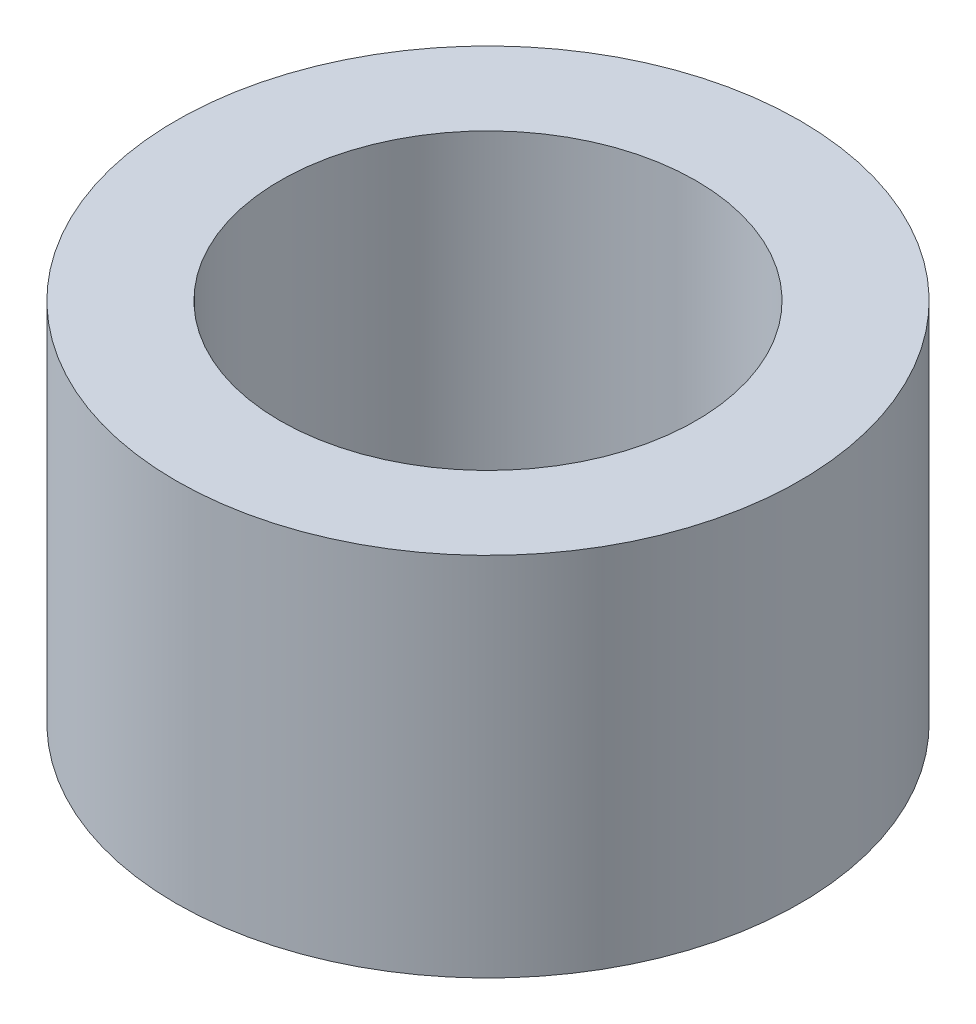
ISO-10303-21;
HEADER;
FILE_DESCRIPTION(('STEP AP214'),'2;1');
FILE_NAME('part.step','',(''),(''),'','','');
FILE_SCHEMA(('AUTOMOTIVE_DESIGN { 1 0 10303 214 1 1 1 1 }'));
ENDSEC;
DATA;
#1=APPLICATION_CONTEXT('core data for automotive mechanical design processes');
#2=APPLICATION_PROTOCOL_DEFINITION('international standard','automotive_design',2000,#1);
#3=PRODUCT_CONTEXT('',#1,'mechanical');
#4=PRODUCT('Part','Part','',(#3));
#5=PRODUCT_RELATED_PRODUCT_CATEGORY('part','',(#4));
#6=PRODUCT_DEFINITION_FORMATION('','',#4);
#7=PRODUCT_DEFINITION_CONTEXT('part definition',#1,'design');
#8=PRODUCT_DEFINITION('design','',#6,#7);
#9=PRODUCT_DEFINITION_SHAPE('','',#8);
#10=(LENGTH_UNIT() NAMED_UNIT(*) SI_UNIT(.MILLI.,.METRE.));
#11=(NAMED_UNIT(*) PLANE_ANGLE_UNIT() SI_UNIT($,.RADIAN.));
#12=(NAMED_UNIT(*) SI_UNIT($,.STERADIAN.) SOLID_ANGLE_UNIT());
#13=UNCERTAINTY_MEASURE_WITH_UNIT(LENGTH_MEASURE(1.E-05),#10,'distance_accuracy_value','');
#14=(GEOMETRIC_REPRESENTATION_CONTEXT(3) GLOBAL_UNCERTAINTY_ASSIGNED_CONTEXT((#13)) GLOBAL_UNIT_ASSIGNED_CONTEXT((#10,
#11,#12)) REPRESENTATION_CONTEXT('',''));
#15=CARTESIAN_POINT('',(0.,0.,0.));
#16=DIRECTION('',(0.,0.,1.));
#17=DIRECTION('',(1.,0.,0.));
#18=AXIS2_PLACEMENT_3D('',#15,#16,#17);
#19=CARTESIAN_POINT('',(0.,11.176,0.));
#20=DIRECTION('',(0.,1.,0.));
#21=DIRECTION('',(0.,0.,1.));
#22=AXIS2_PLACEMENT_3D('',#19,#20,#21);
#23=PLANE('',#22);
#24=CARTESIAN_POINT('',(0.,11.176,0.));
#25=DIRECTION('',(0.,1.,0.));
#26=DIRECTION('',(0.,0.,1.));
#27=AXIS2_PLACEMENT_3D('',#24,#25,#26);
#28=CIRCLE('',#27,9.52500000000001);
#29=CARTESIAN_POINT('',(0.,11.176,9.52500000000001));
#30=VERTEX_POINT('',#29);
#31=EDGE_CURVE('E10',#30,#30,#28,.T.);
#32=ORIENTED_EDGE('',*,*,#31,.T.);
#33=EDGE_LOOP('',(#32));
#34=FACE_BOUND('',#33,.T.);
#35=CARTESIAN_POINT('',(0.,11.176,0.));
#36=DIRECTION('',(0.,1.,0.));
#37=DIRECTION('',(0.,0.,1.));
#38=AXIS2_PLACEMENT_3D('',#35,#36,#37);
#39=CIRCLE('',#38,6.35);
#40=CARTESIAN_POINT('',(0.,11.176,6.35));
#41=VERTEX_POINT('',#40);
#42=EDGE_CURVE('E42',#41,#41,#39,.T.);
#43=ORIENTED_EDGE('',*,*,#42,.F.);
#44=EDGE_LOOP('',(#43));
#45=FACE_BOUND('',#44,.T.);
#46=ADVANCED_FACE('F31',(#34,#45),#23,.T.);
#47=CARTESIAN_POINT('',(0.,0.,0.));
#48=DIRECTION('',(0.,1.,0.));
#49=DIRECTION('',(0.,0.,1.));
#50=AXIS2_PLACEMENT_3D('',#47,#48,#49);
#51=PLANE('',#50);
#52=CARTESIAN_POINT('',(0.,0.,0.));
#53=DIRECTION('',(0.,1.,0.));
#54=DIRECTION('',(0.,0.,1.));
#55=AXIS2_PLACEMENT_3D('',#52,#53,#54);
#56=CIRCLE('',#55,9.52500000000001);
#57=CARTESIAN_POINT('',(0.,0.,9.52500000000001));
#58=VERTEX_POINT('',#57);
#59=EDGE_CURVE('E35',#58,#58,#56,.T.);
#60=ORIENTED_EDGE('',*,*,#59,.F.);
#61=EDGE_LOOP('',(#60));
#62=FACE_BOUND('',#61,.T.);
#63=CARTESIAN_POINT('',(0.,0.,0.));
#64=DIRECTION('',(0.,1.,0.));
#65=DIRECTION('',(0.,0.,1.));
#66=AXIS2_PLACEMENT_3D('',#63,#64,#65);
#67=CIRCLE('',#66,6.35);
#68=CARTESIAN_POINT('',(0.,0.,6.35));
#69=VERTEX_POINT('',#68);
#70=EDGE_CURVE('E44',#69,#69,#67,.T.);
#71=ORIENTED_EDGE('',*,*,#70,.T.);
#72=EDGE_LOOP('',(#71));
#73=FACE_BOUND('',#72,.T.);
#74=ADVANCED_FACE('F54',(#62,#73),#51,.F.);
#75=CARTESIAN_POINT('',(0.,11.176,0.));
#76=DIRECTION('',(0.,-1.,0.));
#77=DIRECTION('',(0.,0.,-1.));
#78=AXIS2_PLACEMENT_3D('',#75,#76,#77);
#79=CYLINDRICAL_SURFACE('',#78,9.52500000000001);
#80=ORIENTED_EDGE('',*,*,#31,.F.);
#81=EDGE_LOOP('',(#80));
#82=FACE_BOUND('',#81,.T.);
#83=ORIENTED_EDGE('',*,*,#59,.T.);
#84=EDGE_LOOP('',(#83));
#85=FACE_BOUND('',#84,.T.);
#86=ADVANCED_FACE('F33',(#82,#85),#79,.T.);
#87=CARTESIAN_POINT('',(0.,11.176,0.));
#88=DIRECTION('',(0.,-1.,0.));
#89=DIRECTION('',(0.,0.,-1.));
#90=AXIS2_PLACEMENT_3D('',#87,#88,#89);
#91=CYLINDRICAL_SURFACE('',#90,6.35);
#92=ORIENTED_EDGE('',*,*,#42,.T.);
#93=EDGE_LOOP('',(#92));
#94=FACE_BOUND('',#93,.T.);
#95=ORIENTED_EDGE('',*,*,#70,.F.);
#96=EDGE_LOOP('',(#95));
#97=FACE_BOUND('',#96,.T.);
#98=ADVANCED_FACE('F50',(#94,#97),#91,.F.);
#99=CLOSED_SHELL('',(#46,#74,#86,#98));
#100=MANIFOLD_SOLID_BREP('B2',#99);
#101=ADVANCED_BREP_SHAPE_REPRESENTATION('',(#18,#100),#14);
#102=SHAPE_DEFINITION_REPRESENTATION(#9,#101);
ENDSEC;
END-ISO-10303-21;
